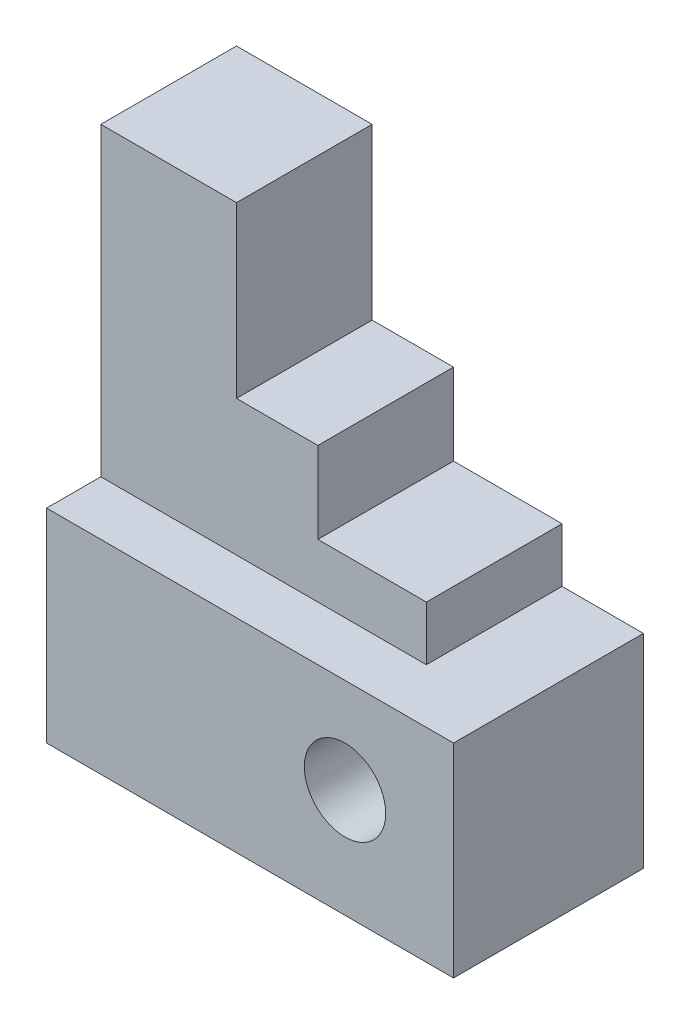
ISO-10303-21;
HEADER;
FILE_DESCRIPTION(('STEP AP214'),'2;1');
FILE_NAME('part.step','',(''),(''),'','','');
FILE_SCHEMA(('AUTOMOTIVE_DESIGN { 1 0 10303 214 1 1 1 1 }'));
ENDSEC;
DATA;
#1=APPLICATION_CONTEXT('core data for automotive mechanical design processes');
#2=APPLICATION_PROTOCOL_DEFINITION('international standard','automotive_design',2000,#1);
#3=PRODUCT_CONTEXT('',#1,'mechanical');
#4=PRODUCT('Part','Part','',(#3));
#5=PRODUCT_RELATED_PRODUCT_CATEGORY('part','',(#4));
#6=PRODUCT_DEFINITION_FORMATION('','',#4);
#7=PRODUCT_DEFINITION_CONTEXT('part definition',#1,'design');
#8=PRODUCT_DEFINITION('design','',#6,#7);
#9=PRODUCT_DEFINITION_SHAPE('','',#8);
#10=(LENGTH_UNIT() NAMED_UNIT(*) SI_UNIT(.MILLI.,.METRE.));
#11=(NAMED_UNIT(*) PLANE_ANGLE_UNIT() SI_UNIT($,.RADIAN.));
#12=(NAMED_UNIT(*) SI_UNIT($,.STERADIAN.) SOLID_ANGLE_UNIT());
#13=UNCERTAINTY_MEASURE_WITH_UNIT(LENGTH_MEASURE(1.E-05),#10,'distance_accuracy_value','');
#14=(GEOMETRIC_REPRESENTATION_CONTEXT(3) GLOBAL_UNCERTAINTY_ASSIGNED_CONTEXT((#13)) GLOBAL_UNIT_ASSIGNED_CONTEXT((#10,
#11,#12)) REPRESENTATION_CONTEXT('',''));
#15=CARTESIAN_POINT('',(0.,0.,0.));
#16=DIRECTION('',(0.,0.,1.));
#17=DIRECTION('',(1.,0.,0.));
#18=AXIS2_PLACEMENT_3D('',#15,#16,#17);
#19=CARTESIAN_POINT('',(0.,30.,28.));
#20=DIRECTION('',(0.,-1.,0.));
#21=DIRECTION('',(0.,0.,-1.));
#22=AXIS2_PLACEMENT_3D('',#19,#20,#21);
#23=PLANE('',#22);
#24=DIRECTION('',(0.,0.,-1.));
#25=VECTOR('',#24,1.);
#26=CARTESIAN_POINT('',(-12.,30.,20.));
#27=LINE('',#26,#25);
#28=CARTESIAN_POINT('',(-12.,30.,20.));
#29=VERTEX_POINT('',#28);
#30=CARTESIAN_POINT('',(-12.,30.,0.));
#31=VERTEX_POINT('',#30);
#32=EDGE_CURVE('E184',#29,#31,#27,.T.);
#33=ORIENTED_EDGE('',*,*,#32,.F.);
#34=DIRECTION('',(-1.,0.,0.));
#35=VECTOR('',#34,1.);
#36=CARTESIAN_POINT('',(0.,30.,20.));
#37=LINE('',#36,#35);
#38=CARTESIAN_POINT('',(-60.,30.,20.));
#39=VERTEX_POINT('',#38);
#40=EDGE_CURVE('E155',#29,#39,#37,.T.);
#41=ORIENTED_EDGE('',*,*,#40,.T.);
#42=DIRECTION('',(0.,0.,-1.));
#43=VECTOR('',#42,1.);
#44=CARTESIAN_POINT('',(-60.,30.,28.));
#45=LINE('',#44,#43);
#46=CARTESIAN_POINT('',(-60.,30.,28.));
#47=VERTEX_POINT('',#46);
#48=EDGE_CURVE('E11',#47,#39,#45,.T.);
#49=ORIENTED_EDGE('',*,*,#48,.F.);
#50=DIRECTION('',(-1.,0.,0.));
#51=VECTOR('',#50,1.);
#52=CARTESIAN_POINT('',(0.,30.,28.));
#53=LINE('',#52,#51);
#54=CARTESIAN_POINT('',(0.,30.,28.));
#55=VERTEX_POINT('',#54);
#56=EDGE_CURVE('E90',#55,#47,#53,.T.);
#57=ORIENTED_EDGE('',*,*,#56,.F.);
#58=DIRECTION('',(0.,0.,-1.));
#59=VECTOR('',#58,1.);
#60=CARTESIAN_POINT('',(0.,30.,28.));
#61=LINE('',#60,#59);
#62=CARTESIAN_POINT('',(0.,30.,0.));
#63=VERTEX_POINT('',#62);
#64=EDGE_CURVE('E235',#55,#63,#61,.T.);
#65=ORIENTED_EDGE('',*,*,#64,.T.);
#66=DIRECTION('',(-1.,0.,0.));
#67=VECTOR('',#66,1.);
#68=CARTESIAN_POINT('',(0.,30.,0.));
#69=LINE('',#68,#67);
#70=EDGE_CURVE('E147',#63,#31,#69,.T.);
#71=ORIENTED_EDGE('',*,*,#70,.T.);
#72=EDGE_LOOP('',(#33,#41,#49,#57,#65,#71));
#73=FACE_BOUND('',#72,.T.);
#74=ADVANCED_FACE('F43',(#73),#23,.F.);
#75=CARTESIAN_POINT('',(-60.,0.,28.));
#76=DIRECTION('',(-1.,0.,0.));
#77=DIRECTION('',(0.,0.,1.));
#78=AXIS2_PLACEMENT_3D('',#75,#76,#77);
#79=PLANE('',#78);
#80=DIRECTION('',(0.,1.,0.));
#81=VECTOR('',#80,1.);
#82=CARTESIAN_POINT('',(-60.,0.,0.));
#83=LINE('',#82,#81);
#84=CARTESIAN_POINT('',(-60.,0.,0.));
#85=VERTEX_POINT('',#84);
#86=CARTESIAN_POINT('',(-60.,75.,0.));
#87=VERTEX_POINT('',#86);
#88=EDGE_CURVE('E239',#85,#87,#83,.T.);
#89=ORIENTED_EDGE('',*,*,#88,.F.);
#90=DIRECTION('',(0.,0.,-1.));
#91=VECTOR('',#90,1.);
#92=CARTESIAN_POINT('',(-60.,0.,28.));
#93=LINE('',#92,#91);
#94=CARTESIAN_POINT('',(-60.,0.,28.));
#95=VERTEX_POINT('',#94);
#96=EDGE_CURVE('E51',#95,#85,#93,.T.);
#97=ORIENTED_EDGE('',*,*,#96,.F.);
#98=DIRECTION('',(0.,1.,0.));
#99=VECTOR('',#98,1.);
#100=CARTESIAN_POINT('',(-60.,0.,28.));
#101=LINE('',#100,#99);
#102=EDGE_CURVE('E225',#95,#47,#101,.T.);
#103=ORIENTED_EDGE('',*,*,#102,.T.);
#104=ORIENTED_EDGE('',*,*,#48,.T.);
#105=DIRECTION('',(0.,1.,0.));
#106=VECTOR('',#105,1.);
#107=CARTESIAN_POINT('',(-60.,0.,20.));
#108=LINE('',#107,#106);
#109=CARTESIAN_POINT('',(-60.,75.,20.));
#110=VERTEX_POINT('',#109);
#111=EDGE_CURVE('E58',#39,#110,#108,.T.);
#112=ORIENTED_EDGE('',*,*,#111,.T.);
#113=DIRECTION('',(0.,0.,-1.));
#114=VECTOR('',#113,1.);
#115=CARTESIAN_POINT('',(-60.,75.,20.));
#116=LINE('',#115,#114);
#117=EDGE_CURVE('E208',#110,#87,#116,.T.);
#118=ORIENTED_EDGE('',*,*,#117,.T.);
#119=EDGE_LOOP('',(#89,#97,#103,#104,#112,#118));
#120=FACE_BOUND('',#119,.T.);
#121=ADVANCED_FACE('F258',(#120),#79,.T.);
#122=CARTESIAN_POINT('',(0.,0.,28.));
#123=DIRECTION('',(0.,-1.,0.));
#124=DIRECTION('',(0.,0.,-1.));
#125=AXIS2_PLACEMENT_3D('',#122,#123,#124);
#126=PLANE('',#125);
#127=DIRECTION('',(-1.,0.,0.));
#128=VECTOR('',#127,1.);
#129=CARTESIAN_POINT('',(0.,0.,0.));
#130=LINE('',#129,#128);
#131=CARTESIAN_POINT('',(0.,0.,0.));
#132=VERTEX_POINT('',#131);
#133=EDGE_CURVE('E242',#132,#85,#130,.T.);
#134=ORIENTED_EDGE('',*,*,#133,.F.);
#135=DIRECTION('',(0.,0.,-1.));
#136=VECTOR('',#135,1.);
#137=CARTESIAN_POINT('',(0.,0.,28.));
#138=LINE('',#137,#136);
#139=CARTESIAN_POINT('',(0.,0.,28.));
#140=VERTEX_POINT('',#139);
#141=EDGE_CURVE('E250',#140,#132,#138,.T.);
#142=ORIENTED_EDGE('',*,*,#141,.F.);
#143=DIRECTION('',(-1.,0.,0.));
#144=VECTOR('',#143,1.);
#145=CARTESIAN_POINT('',(0.,0.,28.));
#146=LINE('',#145,#144);
#147=EDGE_CURVE('E229',#140,#95,#146,.T.);
#148=ORIENTED_EDGE('',*,*,#147,.T.);
#149=ORIENTED_EDGE('',*,*,#96,.T.);
#150=EDGE_LOOP('',(#134,#142,#148,#149));
#151=FACE_BOUND('',#150,.T.);
#152=ADVANCED_FACE('F256',(#151),#126,.T.);
#153=CARTESIAN_POINT('',(0.,0.,28.));
#154=DIRECTION('',(-1.,0.,0.));
#155=DIRECTION('',(0.,0.,1.));
#156=AXIS2_PLACEMENT_3D('',#153,#154,#155);
#157=PLANE('',#156);
#158=DIRECTION('',(0.,1.,0.));
#159=VECTOR('',#158,1.);
#160=CARTESIAN_POINT('',(0.,0.,0.));
#161=LINE('',#160,#159);
#162=EDGE_CURVE('E85',#132,#63,#161,.T.);
#163=ORIENTED_EDGE('',*,*,#162,.T.);
#164=ORIENTED_EDGE('',*,*,#64,.F.);
#165=DIRECTION('',(0.,1.,0.));
#166=VECTOR('',#165,1.);
#167=CARTESIAN_POINT('',(0.,0.,28.));
#168=LINE('',#167,#166);
#169=EDGE_CURVE('E67',#140,#55,#168,.T.);
#170=ORIENTED_EDGE('',*,*,#169,.F.);
#171=ORIENTED_EDGE('',*,*,#141,.T.);
#172=EDGE_LOOP('',(#163,#164,#170,#171));
#173=FACE_BOUND('',#172,.T.);
#174=ADVANCED_FACE('F264',(#173),#157,.F.);
#175=CARTESIAN_POINT('',(0.,0.,28.));
#176=DIRECTION('',(0.,0.,-1.));
#177=DIRECTION('',(-1.,0.,0.));
#178=AXIS2_PLACEMENT_3D('',#175,#176,#177);
#179=PLANE('',#178);
#180=CARTESIAN_POINT('',(-16.,16.,28.));
#181=DIRECTION('',(0.,0.,1.));
#182=DIRECTION('',(1.,0.,0.));
#183=AXIS2_PLACEMENT_3D('',#180,#181,#182);
#184=CIRCLE('',#183,6.);
#185=CARTESIAN_POINT('',(-10.,16.,28.));
#186=VERTEX_POINT('',#185);
#187=EDGE_CURVE('E412',#186,#186,#184,.T.);
#188=ORIENTED_EDGE('',*,*,#187,.F.);
#189=EDGE_LOOP('',(#188));
#190=FACE_BOUND('',#189,.T.);
#191=ORIENTED_EDGE('',*,*,#56,.T.);
#192=ORIENTED_EDGE('',*,*,#102,.F.);
#193=ORIENTED_EDGE('',*,*,#147,.F.);
#194=ORIENTED_EDGE('',*,*,#169,.T.);
#195=EDGE_LOOP('',(#191,#192,#193,#194));
#196=FACE_BOUND('',#195,.T.);
#197=ADVANCED_FACE('F265',(#190,#196),#179,.F.);
#198=CARTESIAN_POINT('',(0.,0.,0.));
#199=DIRECTION('',(0.,0.,-1.));
#200=DIRECTION('',(-1.,0.,0.));
#201=AXIS2_PLACEMENT_3D('',#198,#199,#200);
#202=PLANE('',#201);
#203=CARTESIAN_POINT('',(-16.,16.,0.));
#204=DIRECTION('',(0.,0.,1.));
#205=DIRECTION('',(1.,0.,0.));
#206=AXIS2_PLACEMENT_3D('',#203,#204,#205);
#207=CIRCLE('',#206,6.);
#208=CARTESIAN_POINT('',(-10.,16.,0.));
#209=VERTEX_POINT('',#208);
#210=EDGE_CURVE('E188',#209,#209,#207,.T.);
#211=ORIENTED_EDGE('',*,*,#210,.T.);
#212=EDGE_LOOP('',(#211));
#213=FACE_BOUND('',#212,.T.);
#214=ORIENTED_EDGE('',*,*,#70,.F.);
#215=ORIENTED_EDGE('',*,*,#162,.F.);
#216=ORIENTED_EDGE('',*,*,#133,.T.);
#217=ORIENTED_EDGE('',*,*,#88,.T.);
#218=DIRECTION('',(1.,0.,0.));
#219=VECTOR('',#218,1.);
#220=CARTESIAN_POINT('',(0.,75.,0.));
#221=LINE('',#220,#219);
#222=CARTESIAN_POINT('',(-40.,75.,0.));
#223=VERTEX_POINT('',#222);
#224=EDGE_CURVE('E158',#87,#223,#221,.T.);
#225=ORIENTED_EDGE('',*,*,#224,.T.);
#226=DIRECTION('',(0.,-1.,0.));
#227=VECTOR('',#226,1.);
#228=CARTESIAN_POINT('',(-40.,0.,0.));
#229=LINE('',#228,#227);
#230=CARTESIAN_POINT('',(-40.,50.,0.));
#231=VERTEX_POINT('',#230);
#232=EDGE_CURVE('E199',#223,#231,#229,.T.);
#233=ORIENTED_EDGE('',*,*,#232,.T.);
#234=DIRECTION('',(1.,0.,0.));
#235=VECTOR('',#234,1.);
#236=CARTESIAN_POINT('',(0.,50.,0.));
#237=LINE('',#236,#235);
#238=CARTESIAN_POINT('',(-28.,50.,0.));
#239=VERTEX_POINT('',#238);
#240=EDGE_CURVE('E195',#231,#239,#237,.T.);
#241=ORIENTED_EDGE('',*,*,#240,.T.);
#242=DIRECTION('',(0.,-1.,0.));
#243=VECTOR('',#242,1.);
#244=CARTESIAN_POINT('',(-28.,0.,0.));
#245=LINE('',#244,#243);
#246=CARTESIAN_POINT('',(-28.,38.,0.));
#247=VERTEX_POINT('',#246);
#248=EDGE_CURVE('E191',#239,#247,#245,.T.);
#249=ORIENTED_EDGE('',*,*,#248,.T.);
#250=DIRECTION('',(1.,0.,0.));
#251=VECTOR('',#250,1.);
#252=CARTESIAN_POINT('',(0.,38.,0.));
#253=LINE('',#252,#251);
#254=CARTESIAN_POINT('',(-12.,38.,0.));
#255=VERTEX_POINT('',#254);
#256=EDGE_CURVE('E187',#247,#255,#253,.T.);
#257=ORIENTED_EDGE('',*,*,#256,.T.);
#258=DIRECTION('',(0.,-1.,0.));
#259=VECTOR('',#258,1.);
#260=CARTESIAN_POINT('',(-12.,0.,0.));
#261=LINE('',#260,#259);
#262=EDGE_CURVE('E141',#255,#31,#261,.T.);
#263=ORIENTED_EDGE('',*,*,#262,.T.);
#264=EDGE_LOOP('',(#214,#215,#216,#217,#225,#233,#241,#249,#257,#263));
#265=FACE_BOUND('',#264,.T.);
#266=ADVANCED_FACE('F262',(#213,#265),#202,.T.);
#267=CARTESIAN_POINT('',(-12.,0.,20.));
#268=DIRECTION('',(1.,0.,0.));
#269=DIRECTION('',(0.,1.,0.));
#270=AXIS2_PLACEMENT_3D('',#267,#268,#269);
#271=PLANE('',#270);
#272=ORIENTED_EDGE('',*,*,#262,.F.);
#273=DIRECTION('',(0.,0.,-1.));
#274=VECTOR('',#273,1.);
#275=CARTESIAN_POINT('',(-12.,38.,20.));
#276=LINE('',#275,#274);
#277=CARTESIAN_POINT('',(-12.,38.,20.));
#278=VERTEX_POINT('',#277);
#279=EDGE_CURVE('E136',#278,#255,#276,.T.);
#280=ORIENTED_EDGE('',*,*,#279,.F.);
#281=DIRECTION('',(0.,-1.,0.));
#282=VECTOR('',#281,1.);
#283=CARTESIAN_POINT('',(-12.,0.,20.));
#284=LINE('',#283,#282);
#285=EDGE_CURVE('E139',#278,#29,#284,.T.);
#286=ORIENTED_EDGE('',*,*,#285,.T.);
#287=ORIENTED_EDGE('',*,*,#32,.T.);
#288=EDGE_LOOP('',(#272,#280,#286,#287));
#289=FACE_BOUND('',#288,.T.);
#290=ADVANCED_FACE('F138',(#289),#271,.T.);
#291=CARTESIAN_POINT('',(0.,38.,20.));
#292=DIRECTION('',(0.,1.,0.));
#293=DIRECTION('',(-1.,0.,0.));
#294=AXIS2_PLACEMENT_3D('',#291,#292,#293);
#295=PLANE('',#294);
#296=ORIENTED_EDGE('',*,*,#256,.F.);
#297=DIRECTION('',(0.,0.,-1.));
#298=VECTOR('',#297,1.);
#299=CARTESIAN_POINT('',(-28.,38.,20.));
#300=LINE('',#299,#298);
#301=CARTESIAN_POINT('',(-28.,38.,20.));
#302=VERTEX_POINT('',#301);
#303=EDGE_CURVE('E148',#302,#247,#300,.T.);
#304=ORIENTED_EDGE('',*,*,#303,.F.);
#305=DIRECTION('',(1.,0.,0.));
#306=VECTOR('',#305,1.);
#307=CARTESIAN_POINT('',(0.,38.,20.));
#308=LINE('',#307,#306);
#309=EDGE_CURVE('E153',#302,#278,#308,.T.);
#310=ORIENTED_EDGE('',*,*,#309,.T.);
#311=ORIENTED_EDGE('',*,*,#279,.T.);
#312=EDGE_LOOP('',(#296,#304,#310,#311));
#313=FACE_BOUND('',#312,.T.);
#314=ADVANCED_FACE('F160',(#313),#295,.T.);
#315=CARTESIAN_POINT('',(-28.,0.,20.));
#316=DIRECTION('',(1.,0.,0.));
#317=DIRECTION('',(0.,0.,-1.));
#318=AXIS2_PLACEMENT_3D('',#315,#316,#317);
#319=PLANE('',#318);
#320=ORIENTED_EDGE('',*,*,#248,.F.);
#321=DIRECTION('',(0.,0.,-1.));
#322=VECTOR('',#321,1.);
#323=CARTESIAN_POINT('',(-28.,50.,20.));
#324=LINE('',#323,#322);
#325=CARTESIAN_POINT('',(-28.,50.,20.));
#326=VERTEX_POINT('',#325);
#327=EDGE_CURVE('E218',#326,#239,#324,.T.);
#328=ORIENTED_EDGE('',*,*,#327,.F.);
#329=DIRECTION('',(0.,-1.,0.));
#330=VECTOR('',#329,1.);
#331=CARTESIAN_POINT('',(-28.,0.,20.));
#332=LINE('',#331,#330);
#333=EDGE_CURVE('E162',#326,#302,#332,.T.);
#334=ORIENTED_EDGE('',*,*,#333,.T.);
#335=ORIENTED_EDGE('',*,*,#303,.T.);
#336=EDGE_LOOP('',(#320,#328,#334,#335));
#337=FACE_BOUND('',#336,.T.);
#338=ADVANCED_FACE('F322',(#337),#319,.T.);
#339=CARTESIAN_POINT('',(0.,50.,20.));
#340=DIRECTION('',(0.,1.,0.));
#341=DIRECTION('',(0.,0.,1.));
#342=AXIS2_PLACEMENT_3D('',#339,#340,#341);
#343=PLANE('',#342);
#344=ORIENTED_EDGE('',*,*,#240,.F.);
#345=DIRECTION('',(0.,0.,-1.));
#346=VECTOR('',#345,1.);
#347=CARTESIAN_POINT('',(-40.,50.,20.));
#348=LINE('',#347,#346);
#349=CARTESIAN_POINT('',(-40.,50.,20.));
#350=VERTEX_POINT('',#349);
#351=EDGE_CURVE('E215',#350,#231,#348,.T.);
#352=ORIENTED_EDGE('',*,*,#351,.F.);
#353=DIRECTION('',(1.,0.,0.));
#354=VECTOR('',#353,1.);
#355=CARTESIAN_POINT('',(0.,50.,20.));
#356=LINE('',#355,#354);
#357=EDGE_CURVE('E165',#350,#326,#356,.T.);
#358=ORIENTED_EDGE('',*,*,#357,.T.);
#359=ORIENTED_EDGE('',*,*,#327,.T.);
#360=EDGE_LOOP('',(#344,#352,#358,#359));
#361=FACE_BOUND('',#360,.T.);
#362=ADVANCED_FACE('F332',(#361),#343,.T.);
#363=CARTESIAN_POINT('',(-40.,0.,20.));
#364=DIRECTION('',(1.,0.,0.));
#365=DIRECTION('',(0.,0.,-1.));
#366=AXIS2_PLACEMENT_3D('',#363,#364,#365);
#367=PLANE('',#366);
#368=ORIENTED_EDGE('',*,*,#232,.F.);
#369=DIRECTION('',(0.,0.,-1.));
#370=VECTOR('',#369,1.);
#371=CARTESIAN_POINT('',(-40.,75.,20.));
#372=LINE('',#371,#370);
#373=CARTESIAN_POINT('',(-40.,75.,20.));
#374=VERTEX_POINT('',#373);
#375=EDGE_CURVE('E212',#374,#223,#372,.T.);
#376=ORIENTED_EDGE('',*,*,#375,.F.);
#377=DIRECTION('',(0.,-1.,0.));
#378=VECTOR('',#377,1.);
#379=CARTESIAN_POINT('',(-40.,0.,20.));
#380=LINE('',#379,#378);
#381=EDGE_CURVE('E172',#374,#350,#380,.T.);
#382=ORIENTED_EDGE('',*,*,#381,.T.);
#383=ORIENTED_EDGE('',*,*,#351,.T.);
#384=EDGE_LOOP('',(#368,#376,#382,#383));
#385=FACE_BOUND('',#384,.T.);
#386=ADVANCED_FACE('F343',(#385),#367,.T.);
#387=CARTESIAN_POINT('',(0.,75.,20.));
#388=DIRECTION('',(0.,1.,0.));
#389=DIRECTION('',(0.,0.,1.));
#390=AXIS2_PLACEMENT_3D('',#387,#388,#389);
#391=PLANE('',#390);
#392=ORIENTED_EDGE('',*,*,#224,.F.);
#393=ORIENTED_EDGE('',*,*,#117,.F.);
#394=DIRECTION('',(1.,0.,0.));
#395=VECTOR('',#394,1.);
#396=CARTESIAN_POINT('',(0.,75.,20.));
#397=LINE('',#396,#395);
#398=EDGE_CURVE('E176',#110,#374,#397,.T.);
#399=ORIENTED_EDGE('',*,*,#398,.T.);
#400=ORIENTED_EDGE('',*,*,#375,.T.);
#401=EDGE_LOOP('',(#392,#393,#399,#400));
#402=FACE_BOUND('',#401,.T.);
#403=ADVANCED_FACE('F354',(#402),#391,.T.);
#404=CARTESIAN_POINT('',(0.,0.,20.));
#405=DIRECTION('',(0.,0.,1.));
#406=DIRECTION('',(1.,0.,0.));
#407=AXIS2_PLACEMENT_3D('',#404,#405,#406);
#408=PLANE('',#407);
#409=ORIENTED_EDGE('',*,*,#285,.F.);
#410=ORIENTED_EDGE('',*,*,#309,.F.);
#411=ORIENTED_EDGE('',*,*,#333,.F.);
#412=ORIENTED_EDGE('',*,*,#357,.F.);
#413=ORIENTED_EDGE('',*,*,#381,.F.);
#414=ORIENTED_EDGE('',*,*,#398,.F.);
#415=ORIENTED_EDGE('',*,*,#111,.F.);
#416=ORIENTED_EDGE('',*,*,#40,.F.);
#417=EDGE_LOOP('',(#409,#410,#411,#412,#413,#414,#415,#416));
#418=FACE_BOUND('',#417,.T.);
#419=ADVANCED_FACE('F151',(#418),#408,.T.);
#420=CARTESIAN_POINT('',(-16.,16.,0.));
#421=DIRECTION('',(0.,0.,1.));
#422=DIRECTION('',(1.,0.,0.));
#423=AXIS2_PLACEMENT_3D('',#420,#421,#422);
#424=CYLINDRICAL_SURFACE('',#423,6.);
#425=ORIENTED_EDGE('',*,*,#210,.F.);
#426=EDGE_LOOP('',(#425));
#427=FACE_BOUND('',#426,.T.);
#428=ORIENTED_EDGE('',*,*,#187,.T.);
#429=EDGE_LOOP('',(#428));
#430=FACE_BOUND('',#429,.T.);
#431=ADVANCED_FACE('F374',(#427,#430),#424,.F.);
#432=CLOSED_SHELL('',(#74,#121,#152,#174,#197,#266,#290,#314,#338,#362,#386,#403,#419,#431));
#433=MANIFOLD_SOLID_BREP('B2',#432);
#434=ADVANCED_BREP_SHAPE_REPRESENTATION('',(#18,#433),#14);
#435=SHAPE_DEFINITION_REPRESENTATION(#9,#434);
ENDSEC;
END-ISO-10303-21;
